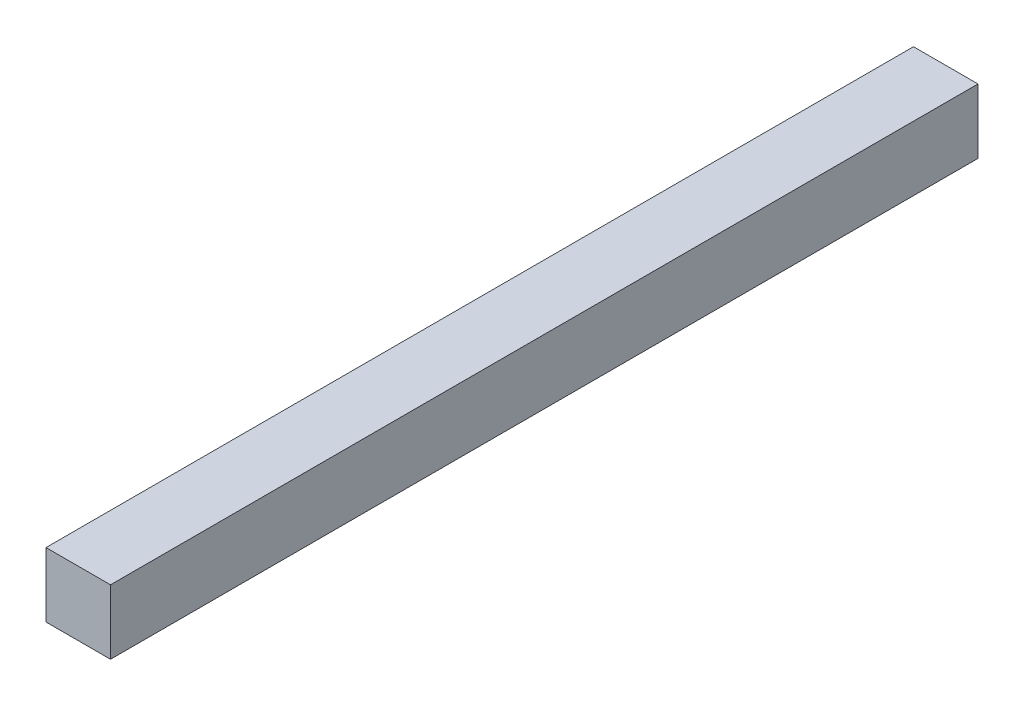
ISO-10303-21;
HEADER;
FILE_DESCRIPTION(('STEP AP214'),'2;1');
FILE_NAME('part.step','',(''),(''),'','','');
FILE_SCHEMA(('AUTOMOTIVE_DESIGN { 1 0 10303 214 1 1 1 1 }'));
ENDSEC;
DATA;
#1=APPLICATION_CONTEXT('core data for automotive mechanical design processes');
#2=APPLICATION_PROTOCOL_DEFINITION('international standard','automotive_design',2000,#1);
#3=PRODUCT_CONTEXT('',#1,'mechanical');
#4=PRODUCT('Part','Part','',(#3));
#5=PRODUCT_RELATED_PRODUCT_CATEGORY('part','',(#4));
#6=PRODUCT_DEFINITION_FORMATION('','',#4);
#7=PRODUCT_DEFINITION_CONTEXT('part definition',#1,'design');
#8=PRODUCT_DEFINITION('design','',#6,#7);
#9=PRODUCT_DEFINITION_SHAPE('','',#8);
#10=(LENGTH_UNIT() NAMED_UNIT(*) SI_UNIT(.MILLI.,.METRE.));
#11=(NAMED_UNIT(*) PLANE_ANGLE_UNIT() SI_UNIT($,.RADIAN.));
#12=(NAMED_UNIT(*) SI_UNIT($,.STERADIAN.) SOLID_ANGLE_UNIT());
#13=UNCERTAINTY_MEASURE_WITH_UNIT(LENGTH_MEASURE(1.E-05),#10,'distance_accuracy_value','');
#14=(GEOMETRIC_REPRESENTATION_CONTEXT(3) GLOBAL_UNCERTAINTY_ASSIGNED_CONTEXT((#13)) GLOBAL_UNIT_ASSIGNED_CONTEXT((#10,
#11,#12)) REPRESENTATION_CONTEXT('',''));
#15=CARTESIAN_POINT('',(0.,0.,0.));
#16=DIRECTION('',(0.,0.,1.));
#17=DIRECTION('',(1.,0.,0.));
#18=AXIS2_PLACEMENT_3D('',#15,#16,#17);
#19=CARTESIAN_POINT('',(0.,0.,42.7));
#20=DIRECTION('',(1.,0.,0.));
#21=DIRECTION('',(0.,0.,-1.));
#22=AXIS2_PLACEMENT_3D('',#19,#20,#21);
#23=PLANE('',#22);
#24=DIRECTION('',(0.,-1.,0.));
#25=VECTOR('',#24,1.);
#26=CARTESIAN_POINT('',(0.,0.,0.));
#27=LINE('',#26,#25);
#28=CARTESIAN_POINT('',(0.,3.175,0.));
#29=VERTEX_POINT('',#28);
#30=CARTESIAN_POINT('',(0.,0.,0.));
#31=VERTEX_POINT('',#30);
#32=EDGE_CURVE('E112',#29,#31,#27,.T.);
#33=ORIENTED_EDGE('',*,*,#32,.T.);
#34=DIRECTION('',(0.,0.,-1.));
#35=VECTOR('',#34,1.);
#36=CARTESIAN_POINT('',(0.,0.,42.7));
#37=LINE('',#36,#35);
#38=CARTESIAN_POINT('',(0.,0.,42.7));
#39=VERTEX_POINT('',#38);
#40=EDGE_CURVE('E11',#39,#31,#37,.T.);
#41=ORIENTED_EDGE('',*,*,#40,.F.);
#42=DIRECTION('',(0.,-1.,0.));
#43=VECTOR('',#42,1.);
#44=CARTESIAN_POINT('',(0.,0.,42.7));
#45=LINE('',#44,#43);
#46=CARTESIAN_POINT('',(0.,3.175,42.7));
#47=VERTEX_POINT('',#46);
#48=EDGE_CURVE('E94',#47,#39,#45,.T.);
#49=ORIENTED_EDGE('',*,*,#48,.F.);
#50=DIRECTION('',(0.,0.,-1.));
#51=VECTOR('',#50,1.);
#52=CARTESIAN_POINT('',(0.,3.175,42.7));
#53=LINE('',#52,#51);
#54=EDGE_CURVE('E108',#47,#29,#53,.T.);
#55=ORIENTED_EDGE('',*,*,#54,.T.);
#56=EDGE_LOOP('',(#33,#41,#49,#55));
#57=FACE_BOUND('',#56,.T.);
#58=ADVANCED_FACE('F42',(#57),#23,.F.);
#59=CARTESIAN_POINT('',(0.,0.,42.7));
#60=DIRECTION('',(0.,1.,0.));
#61=DIRECTION('',(0.,0.,1.));
#62=AXIS2_PLACEMENT_3D('',#59,#60,#61);
#63=PLANE('',#62);
#64=DIRECTION('',(1.,0.,0.));
#65=VECTOR('',#64,1.);
#66=CARTESIAN_POINT('',(0.,0.,0.));
#67=LINE('',#66,#65);
#68=CARTESIAN_POINT('',(3.175,0.,0.));
#69=VERTEX_POINT('',#68);
#70=EDGE_CURVE('E99',#31,#69,#67,.T.);
#71=ORIENTED_EDGE('',*,*,#70,.T.);
#72=DIRECTION('',(0.,0.,-1.));
#73=VECTOR('',#72,1.);
#74=CARTESIAN_POINT('',(3.175,0.,42.7));
#75=LINE('',#74,#73);
#76=CARTESIAN_POINT('',(3.175,0.,42.7));
#77=VERTEX_POINT('',#76);
#78=EDGE_CURVE('E51',#77,#69,#75,.T.);
#79=ORIENTED_EDGE('',*,*,#78,.F.);
#80=DIRECTION('',(1.,0.,0.));
#81=VECTOR('',#80,1.);
#82=CARTESIAN_POINT('',(0.,0.,42.7));
#83=LINE('',#82,#81);
#84=EDGE_CURVE('E89',#39,#77,#83,.T.);
#85=ORIENTED_EDGE('',*,*,#84,.F.);
#86=ORIENTED_EDGE('',*,*,#40,.T.);
#87=EDGE_LOOP('',(#71,#79,#85,#86));
#88=FACE_BOUND('',#87,.T.);
#89=ADVANCED_FACE('F98',(#88),#63,.F.);
#90=CARTESIAN_POINT('',(3.175,0.,42.7));
#91=DIRECTION('',(-1.,0.,0.));
#92=DIRECTION('',(0.,0.,1.));
#93=AXIS2_PLACEMENT_3D('',#90,#91,#92);
#94=PLANE('',#93);
#95=DIRECTION('',(0.,1.,0.));
#96=VECTOR('',#95,1.);
#97=CARTESIAN_POINT('',(3.175,0.,0.));
#98=LINE('',#97,#96);
#99=CARTESIAN_POINT('',(3.175,3.175,0.));
#100=VERTEX_POINT('',#99);
#101=EDGE_CURVE('E76',#69,#100,#98,.T.);
#102=ORIENTED_EDGE('',*,*,#101,.T.);
#103=DIRECTION('',(0.,0.,-1.));
#104=VECTOR('',#103,1.);
#105=CARTESIAN_POINT('',(3.175,3.175,42.7));
#106=LINE('',#105,#104);
#107=CARTESIAN_POINT('',(3.175,3.175,42.7));
#108=VERTEX_POINT('',#107);
#109=EDGE_CURVE('E101',#108,#100,#106,.T.);
#110=ORIENTED_EDGE('',*,*,#109,.F.);
#111=DIRECTION('',(0.,1.,0.));
#112=VECTOR('',#111,1.);
#113=CARTESIAN_POINT('',(3.175,0.,42.7));
#114=LINE('',#113,#112);
#115=EDGE_CURVE('E92',#77,#108,#114,.T.);
#116=ORIENTED_EDGE('',*,*,#115,.F.);
#117=ORIENTED_EDGE('',*,*,#78,.T.);
#118=EDGE_LOOP('',(#102,#110,#116,#117));
#119=FACE_BOUND('',#118,.T.);
#120=ADVANCED_FACE('F102',(#119),#94,.F.);
#121=CARTESIAN_POINT('',(0.,3.175,42.7));
#122=DIRECTION('',(0.,-1.,0.));
#123=DIRECTION('',(0.,0.,-1.));
#124=AXIS2_PLACEMENT_3D('',#121,#122,#123);
#125=PLANE('',#124);
#126=DIRECTION('',(-1.,0.,0.));
#127=VECTOR('',#126,1.);
#128=CARTESIAN_POINT('',(0.,3.175,0.));
#129=LINE('',#128,#127);
#130=EDGE_CURVE('E82',#100,#29,#129,.T.);
#131=ORIENTED_EDGE('',*,*,#130,.T.);
#132=ORIENTED_EDGE('',*,*,#54,.F.);
#133=DIRECTION('',(-1.,0.,0.));
#134=VECTOR('',#133,1.);
#135=CARTESIAN_POINT('',(0.,3.175,42.7));
#136=LINE('',#135,#134);
#137=EDGE_CURVE('E59',#108,#47,#136,.T.);
#138=ORIENTED_EDGE('',*,*,#137,.F.);
#139=ORIENTED_EDGE('',*,*,#109,.T.);
#140=EDGE_LOOP('',(#131,#132,#138,#139));
#141=FACE_BOUND('',#140,.T.);
#142=ADVANCED_FACE('F123',(#141),#125,.F.);
#143=CARTESIAN_POINT('',(0.,0.,42.7));
#144=DIRECTION('',(0.,0.,-1.));
#145=DIRECTION('',(-1.,0.,0.));
#146=AXIS2_PLACEMENT_3D('',#143,#144,#145);
#147=PLANE('',#146);
#148=ORIENTED_EDGE('',*,*,#48,.T.);
#149=ORIENTED_EDGE('',*,*,#84,.T.);
#150=ORIENTED_EDGE('',*,*,#115,.T.);
#151=ORIENTED_EDGE('',*,*,#137,.T.);
#152=EDGE_LOOP('',(#148,#149,#150,#151));
#153=FACE_BOUND('',#152,.T.);
#154=ADVANCED_FACE('F90',(#153),#147,.F.);
#155=CARTESIAN_POINT('',(0.,0.,0.));
#156=DIRECTION('',(0.,0.,-1.));
#157=DIRECTION('',(-1.,0.,0.));
#158=AXIS2_PLACEMENT_3D('',#155,#156,#157);
#159=PLANE('',#158);
#160=ORIENTED_EDGE('',*,*,#32,.F.);
#161=ORIENTED_EDGE('',*,*,#130,.F.);
#162=ORIENTED_EDGE('',*,*,#101,.F.);
#163=ORIENTED_EDGE('',*,*,#70,.F.);
#164=EDGE_LOOP('',(#160,#161,#162,#163));
#165=FACE_BOUND('',#164,.T.);
#166=ADVANCED_FACE('F126',(#165),#159,.T.);
#167=CLOSED_SHELL('',(#58,#89,#120,#142,#154,#166));
#168=MANIFOLD_SOLID_BREP('B2',#167);
#169=ADVANCED_BREP_SHAPE_REPRESENTATION('',(#18,#168),#14);
#170=SHAPE_DEFINITION_REPRESENTATION(#9,#169);
ENDSEC;
END-ISO-10303-21;
